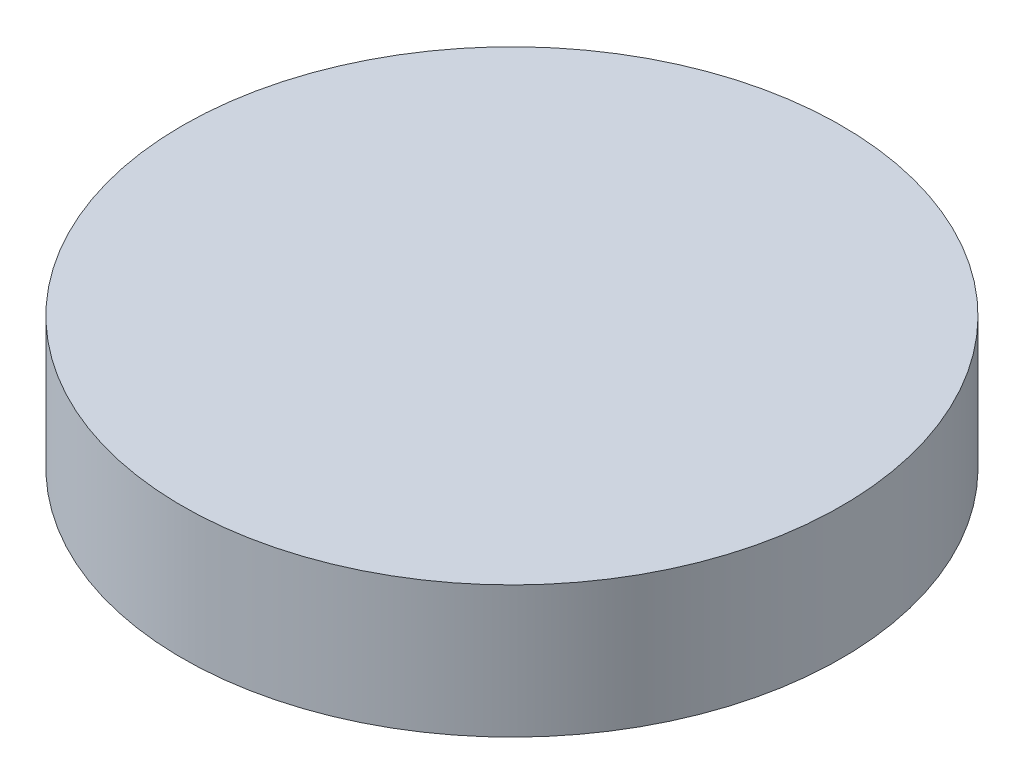
ISO-10303-21;
HEADER;
FILE_DESCRIPTION(('STEP AP214'),'2;1');
FILE_NAME('part.step','',(''),(''),'','','');
FILE_SCHEMA(('AUTOMOTIVE_DESIGN { 1 0 10303 214 1 1 1 1 }'));
ENDSEC;
DATA;
#1=APPLICATION_CONTEXT('core data for automotive mechanical design processes');
#2=APPLICATION_PROTOCOL_DEFINITION('international standard','automotive_design',2000,#1);
#3=PRODUCT_CONTEXT('',#1,'mechanical');
#4=PRODUCT('Part','Part','',(#3));
#5=PRODUCT_RELATED_PRODUCT_CATEGORY('part','',(#4));
#6=PRODUCT_DEFINITION_FORMATION('','',#4);
#7=PRODUCT_DEFINITION_CONTEXT('part definition',#1,'design');
#8=PRODUCT_DEFINITION('design','',#6,#7);
#9=PRODUCT_DEFINITION_SHAPE('','',#8);
#10=(LENGTH_UNIT() NAMED_UNIT(*) SI_UNIT(.MILLI.,.METRE.));
#11=(NAMED_UNIT(*) PLANE_ANGLE_UNIT() SI_UNIT($,.RADIAN.));
#12=(NAMED_UNIT(*) SI_UNIT($,.STERADIAN.) SOLID_ANGLE_UNIT());
#13=UNCERTAINTY_MEASURE_WITH_UNIT(LENGTH_MEASURE(1.E-05),#10,'distance_accuracy_value','');
#14=(GEOMETRIC_REPRESENTATION_CONTEXT(3) GLOBAL_UNCERTAINTY_ASSIGNED_CONTEXT((#13)) GLOBAL_UNIT_ASSIGNED_CONTEXT((#10,
#11,#12)) REPRESENTATION_CONTEXT('',''));
#15=CARTESIAN_POINT('',(0.,0.,0.));
#16=DIRECTION('',(0.,0.,1.));
#17=DIRECTION('',(1.,0.,0.));
#18=AXIS2_PLACEMENT_3D('',#15,#16,#17);
#19=CARTESIAN_POINT('',(0.,0.,0.));
#20=DIRECTION('',(0.,1.,0.));
#21=DIRECTION('',(-1.,0.,0.));
#22=AXIS2_PLACEMENT_3D('',#19,#20,#21);
#23=PLANE('',#22);
#24=CARTESIAN_POINT('',(0.,0.,0.));
#25=DIRECTION('',(0.,1.,0.));
#26=DIRECTION('',(-1.,0.,0.));
#27=AXIS2_PLACEMENT_3D('',#24,#25,#26);
#28=CIRCLE('',#27,1.5);
#29=CARTESIAN_POINT('',(-1.5,0.,0.));
#30=VERTEX_POINT('',#29);
#31=EDGE_CURVE('E17',#30,#30,#28,.F.);
#32=ORIENTED_EDGE('',*,*,#31,.F.);
#33=EDGE_LOOP('',(#32));
#34=FACE_BOUND('',#33,.T.);
#35=ADVANCED_FACE('F14',(#34),#23,.T.);
#36=CARTESIAN_POINT('',(0.,-0.6,0.));
#37=DIRECTION('',(0.,1.,0.));
#38=DIRECTION('',(-1.,0.,0.));
#39=AXIS2_PLACEMENT_3D('',#36,#37,#38);
#40=CYLINDRICAL_SURFACE('',#39,1.5);
#41=ORIENTED_EDGE('',*,*,#31,.T.);
#42=EDGE_LOOP('',(#41));
#43=FACE_BOUND('',#42,.T.);
#44=CARTESIAN_POINT('',(0.,-0.6,0.));
#45=DIRECTION('',(0.,1.,0.));
#46=DIRECTION('',(-1.,0.,0.));
#47=AXIS2_PLACEMENT_3D('',#44,#45,#46);
#48=CIRCLE('',#47,1.5);
#49=CARTESIAN_POINT('',(-1.5,-0.599999999999998,0.));
#50=VERTEX_POINT('',#49);
#51=EDGE_CURVE('E10',#50,#50,#48,.T.);
#52=ORIENTED_EDGE('',*,*,#51,.T.);
#53=EDGE_LOOP('',(#52));
#54=FACE_BOUND('',#53,.T.);
#55=ADVANCED_FACE('F26',(#43,#54),#40,.T.);
#56=CARTESIAN_POINT('',(0.,-0.6,0.));
#57=DIRECTION('',(0.,1.,0.));
#58=DIRECTION('',(-1.,0.,0.));
#59=AXIS2_PLACEMENT_3D('',#56,#57,#58);
#60=PLANE('',#59);
#61=ORIENTED_EDGE('',*,*,#51,.F.);
#62=EDGE_LOOP('',(#61));
#63=FACE_BOUND('',#62,.T.);
#64=ADVANCED_FACE('F33',(#63),#60,.F.);
#65=CLOSED_SHELL('',(#35,#55,#64));
#66=MANIFOLD_SOLID_BREP('B1',#65);
#67=ADVANCED_BREP_SHAPE_REPRESENTATION('',(#18,#66),#14);
#68=SHAPE_DEFINITION_REPRESENTATION(#9,#67);
ENDSEC;
END-ISO-10303-21;
